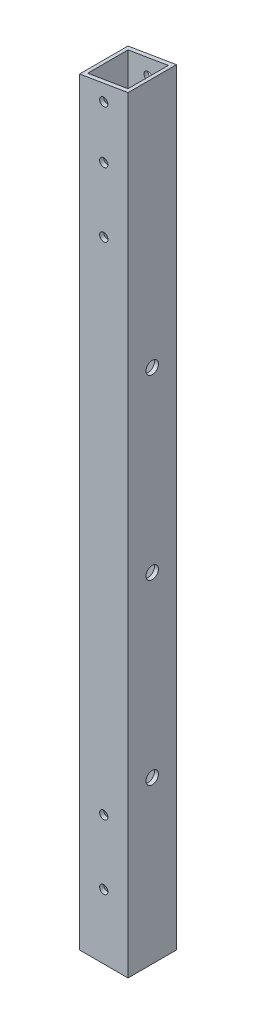
ISO-10303-21;
HEADER;
FILE_DESCRIPTION(('STEP AP214'),'2;1');
FILE_NAME('part.step','',(''),(''),'','','');
FILE_SCHEMA(('AUTOMOTIVE_DESIGN { 1 0 10303 214 1 1 1 1 }'));
ENDSEC;
DATA;
#1=APPLICATION_CONTEXT('core data for automotive mechanical design processes');
#2=APPLICATION_PROTOCOL_DEFINITION('international standard','automotive_design',2000,#1);
#3=PRODUCT_CONTEXT('',#1,'mechanical');
#4=PRODUCT('Part','Part','',(#3));
#5=PRODUCT_RELATED_PRODUCT_CATEGORY('part','',(#4));
#6=PRODUCT_DEFINITION_FORMATION('','',#4);
#7=PRODUCT_DEFINITION_CONTEXT('part definition',#1,'design');
#8=PRODUCT_DEFINITION('design','',#6,#7);
#9=PRODUCT_DEFINITION_SHAPE('','',#8);
#10=(LENGTH_UNIT() NAMED_UNIT(*) SI_UNIT(.MILLI.,.METRE.));
#11=(NAMED_UNIT(*) PLANE_ANGLE_UNIT() SI_UNIT($,.RADIAN.));
#12=(NAMED_UNIT(*) SI_UNIT($,.STERADIAN.) SOLID_ANGLE_UNIT());
#13=UNCERTAINTY_MEASURE_WITH_UNIT(LENGTH_MEASURE(1.E-05),#10,'distance_accuracy_value','');
#14=(GEOMETRIC_REPRESENTATION_CONTEXT(3) GLOBAL_UNCERTAINTY_ASSIGNED_CONTEXT((#13)) GLOBAL_UNIT_ASSIGNED_CONTEXT((#10,
#11,#12)) REPRESENTATION_CONTEXT('',''));
#15=CARTESIAN_POINT('',(0.,0.,0.));
#16=DIRECTION('',(0.,0.,1.));
#17=DIRECTION('',(1.,0.,0.));
#18=AXIS2_PLACEMENT_3D('',#15,#16,#17);
#19=CARTESIAN_POINT('',(-685.8,596.9,0.));
#20=DIRECTION('',(0.,0.,-1.));
#21=DIRECTION('',(-1.,0.,0.));
#22=AXIS2_PLACEMENT_3D('',#19,#20,#21);
#23=PLANE('',#22);
#24=CARTESIAN_POINT('',(-704.85,546.1,0.));
#25=DIRECTION('',(0.,0.,-1.));
#26=DIRECTION('',(-1.,0.,0.));
#27=AXIS2_PLACEMENT_3D('',#24,#25,#26);
#28=CIRCLE('',#27,3.26389999999999);
#29=CARTESIAN_POINT('',(-708.1139,546.1,0.));
#30=VERTEX_POINT('',#29);
#31=EDGE_CURVE('E163',#30,#30,#28,.F.);
#32=ORIENTED_EDGE('',*,*,#31,.F.);
#33=EDGE_LOOP('',(#32));
#34=FACE_BOUND('',#33,.T.);
#35=CARTESIAN_POINT('',(-704.85,587.375,0.));
#36=DIRECTION('',(0.,0.,-1.));
#37=DIRECTION('',(-1.,0.,0.));
#38=AXIS2_PLACEMENT_3D('',#35,#36,#37);
#39=CIRCLE('',#38,3.26389999999999);
#40=CARTESIAN_POINT('',(-708.1139,587.375,0.));
#41=VERTEX_POINT('',#40);
#42=EDGE_CURVE('E159',#41,#41,#39,.F.);
#43=ORIENTED_EDGE('',*,*,#42,.F.);
#44=EDGE_LOOP('',(#43));
#45=FACE_BOUND('',#44,.T.);
#46=DIRECTION('',(-1.,0.,0.));
#47=VECTOR('',#46,1.);
#48=CARTESIAN_POINT('',(-685.8,0.,0.));
#49=LINE('',#48,#47);
#50=CARTESIAN_POINT('',(-685.8,0.,0.));
#51=VERTEX_POINT('',#50);
#52=CARTESIAN_POINT('',(-723.9,0.,0.));
#53=VERTEX_POINT('',#52);
#54=EDGE_CURVE('E234',#51,#53,#49,.T.);
#55=ORIENTED_EDGE('',*,*,#54,.F.);
#56=DIRECTION('',(0.,-1.,0.));
#57=VECTOR('',#56,1.);
#58=CARTESIAN_POINT('',(-685.8,596.9,0.));
#59=LINE('',#58,#57);
#60=CARTESIAN_POINT('',(-685.8,603.25,0.));
#61=VERTEX_POINT('',#60);
#62=EDGE_CURVE('E122',#61,#51,#59,.T.);
#63=ORIENTED_EDGE('',*,*,#62,.F.);
#64=DIRECTION('',(0.986393923832144,0.164398987305358,0.));
#65=VECTOR('',#64,1.);
#66=CARTESIAN_POINT('',(-686.82972972973,603.078378378378,0.));
#67=LINE('',#66,#65);
#68=CARTESIAN_POINT('',(-723.9,596.9,0.));
#69=VERTEX_POINT('',#68);
#70=EDGE_CURVE('E255',#69,#61,#67,.T.);
#71=ORIENTED_EDGE('',*,*,#70,.F.);
#72=DIRECTION('',(0.,-1.,0.));
#73=VECTOR('',#72,1.);
#74=CARTESIAN_POINT('',(-723.9,596.9,0.));
#75=LINE('',#74,#73);
#76=EDGE_CURVE('E50',#69,#53,#75,.T.);
#77=ORIENTED_EDGE('',*,*,#76,.T.);
#78=EDGE_LOOP('',(#55,#63,#71,#77));
#79=FACE_BOUND('',#78,.T.);
#80=CARTESIAN_POINT('',(-704.85,495.3,0.));
#81=DIRECTION('',(0.,0.,-1.));
#82=DIRECTION('',(-1.,0.,0.));
#83=AXIS2_PLACEMENT_3D('',#80,#81,#82);
#84=CIRCLE('',#83,3.26389999999999);
#85=CARTESIAN_POINT('',(-708.1139,495.3,0.));
#86=VERTEX_POINT('',#85);
#87=EDGE_CURVE('E184',#86,#86,#84,.F.);
#88=ORIENTED_EDGE('',*,*,#87,.F.);
#89=EDGE_LOOP('',(#88));
#90=FACE_BOUND('',#89,.T.);
#91=CARTESIAN_POINT('',(-704.85,101.6,0.));
#92=DIRECTION('',(0.,0.,-1.));
#93=DIRECTION('',(-1.,0.,0.));
#94=AXIS2_PLACEMENT_3D('',#91,#92,#93);
#95=CIRCLE('',#94,3.26389999999999);
#96=CARTESIAN_POINT('',(-708.1139,101.6,0.));
#97=VERTEX_POINT('',#96);
#98=EDGE_CURVE('E167',#97,#97,#95,.F.);
#99=ORIENTED_EDGE('',*,*,#98,.F.);
#100=EDGE_LOOP('',(#99));
#101=FACE_BOUND('',#100,.T.);
#102=CARTESIAN_POINT('',(-704.85,50.8,0.));
#103=DIRECTION('',(0.,0.,-1.));
#104=DIRECTION('',(-1.,0.,0.));
#105=AXIS2_PLACEMENT_3D('',#102,#103,#104);
#106=CIRCLE('',#105,3.26389999999999);
#107=CARTESIAN_POINT('',(-708.1139,50.8,0.));
#108=VERTEX_POINT('',#107);
#109=EDGE_CURVE('E473',#108,#108,#106,.F.);
#110=ORIENTED_EDGE('',*,*,#109,.F.);
#111=EDGE_LOOP('',(#110));
#112=FACE_BOUND('',#111,.T.);
#113=ADVANCED_FACE('F33',(#34,#45,#79,#90,#101,#112),#23,.F.);
#114=CARTESIAN_POINT('',(-685.8,596.9,-38.1));
#115=DIRECTION('',(0.,0.,1.));
#116=DIRECTION('',(1.,0.,0.));
#117=AXIS2_PLACEMENT_3D('',#114,#115,#116);
#118=PLANE('',#117);
#119=CARTESIAN_POINT('',(-704.85,50.8,-38.1));
#120=DIRECTION('',(0.,0.,-1.));
#121=DIRECTION('',(-1.,0.,0.));
#122=AXIS2_PLACEMENT_3D('',#119,#120,#121);
#123=CIRCLE('',#122,3.26389999999999);
#124=CARTESIAN_POINT('',(-708.1139,50.8,-38.1));
#125=VERTEX_POINT('',#124);
#126=EDGE_CURVE('E472',#125,#125,#123,.T.);
#127=ORIENTED_EDGE('',*,*,#126,.F.);
#128=EDGE_LOOP('',(#127));
#129=FACE_BOUND('',#128,.T.);
#130=CARTESIAN_POINT('',(-704.85,101.6,-38.1));
#131=DIRECTION('',(0.,0.,-1.));
#132=DIRECTION('',(-1.,0.,0.));
#133=AXIS2_PLACEMENT_3D('',#130,#131,#132);
#134=CIRCLE('',#133,3.26389999999999);
#135=CARTESIAN_POINT('',(-708.1139,101.6,-38.1));
#136=VERTEX_POINT('',#135);
#137=EDGE_CURVE('E174',#136,#136,#134,.T.);
#138=ORIENTED_EDGE('',*,*,#137,.F.);
#139=EDGE_LOOP('',(#138));
#140=FACE_BOUND('',#139,.T.);
#141=CARTESIAN_POINT('',(-704.85,495.3,-38.1));
#142=DIRECTION('',(0.,0.,-1.));
#143=DIRECTION('',(-1.,0.,0.));
#144=AXIS2_PLACEMENT_3D('',#141,#142,#143);
#145=CIRCLE('',#144,3.26389999999999);
#146=CARTESIAN_POINT('',(-708.1139,495.3,-38.1));
#147=VERTEX_POINT('',#146);
#148=EDGE_CURVE('E171',#147,#147,#145,.T.);
#149=ORIENTED_EDGE('',*,*,#148,.F.);
#150=EDGE_LOOP('',(#149));
#151=FACE_BOUND('',#150,.T.);
#152=CARTESIAN_POINT('',(-704.85,587.375,-38.1));
#153=DIRECTION('',(0.,0.,-1.));
#154=DIRECTION('',(-1.,0.,0.));
#155=AXIS2_PLACEMENT_3D('',#152,#153,#154);
#156=CIRCLE('',#155,3.26389999999999);
#157=CARTESIAN_POINT('',(-708.1139,587.375,-38.1));
#158=VERTEX_POINT('',#157);
#159=EDGE_CURVE('E202',#158,#158,#156,.T.);
#160=ORIENTED_EDGE('',*,*,#159,.F.);
#161=EDGE_LOOP('',(#160));
#162=FACE_BOUND('',#161,.T.);
#163=DIRECTION('',(1.,0.,0.));
#164=VECTOR('',#163,1.);
#165=CARTESIAN_POINT('',(-685.8,0.,-38.1));
#166=LINE('',#165,#164);
#167=CARTESIAN_POINT('',(-723.9,0.,-38.1));
#168=VERTEX_POINT('',#167);
#169=CARTESIAN_POINT('',(-685.8,0.,-38.1));
#170=VERTEX_POINT('',#169);
#171=EDGE_CURVE('E240',#168,#170,#166,.T.);
#172=ORIENTED_EDGE('',*,*,#171,.F.);
#173=DIRECTION('',(0.,-1.,0.));
#174=VECTOR('',#173,1.);
#175=CARTESIAN_POINT('',(-723.9,596.9,-38.1));
#176=LINE('',#175,#174);
#177=CARTESIAN_POINT('',(-723.9,596.9,-38.1));
#178=VERTEX_POINT('',#177);
#179=EDGE_CURVE('E132',#178,#168,#176,.T.);
#180=ORIENTED_EDGE('',*,*,#179,.F.);
#181=DIRECTION('',(-0.986393923832144,-0.164398987305358,0.));
#182=VECTOR('',#181,1.);
#183=CARTESIAN_POINT('',(-686.82972972973,603.078378378378,-38.1));
#184=LINE('',#183,#182);
#185=CARTESIAN_POINT('',(-685.8,603.25,-38.1));
#186=VERTEX_POINT('',#185);
#187=EDGE_CURVE('E250',#186,#178,#184,.T.);
#188=ORIENTED_EDGE('',*,*,#187,.F.);
#189=DIRECTION('',(0.,-1.,0.));
#190=VECTOR('',#189,1.);
#191=CARTESIAN_POINT('',(-685.8,596.9,-38.1));
#192=LINE('',#191,#190);
#193=EDGE_CURVE('E134',#186,#170,#192,.T.);
#194=ORIENTED_EDGE('',*,*,#193,.T.);
#195=EDGE_LOOP('',(#172,#180,#188,#194));
#196=FACE_BOUND('',#195,.T.);
#197=CARTESIAN_POINT('',(-704.85,546.1,-38.1));
#198=DIRECTION('',(0.,0.,-1.));
#199=DIRECTION('',(-1.,0.,0.));
#200=AXIS2_PLACEMENT_3D('',#197,#198,#199);
#201=CIRCLE('',#200,3.26389999999999);
#202=CARTESIAN_POINT('',(-708.1139,546.1,-38.1));
#203=VERTEX_POINT('',#202);
#204=EDGE_CURVE('E195',#203,#203,#201,.T.);
#205=ORIENTED_EDGE('',*,*,#204,.F.);
#206=EDGE_LOOP('',(#205));
#207=FACE_BOUND('',#206,.T.);
#208=ADVANCED_FACE('F271',(#129,#140,#151,#162,#196,#207),#118,.F.);
#209=CARTESIAN_POINT('',(-723.9,596.9,-38.1));
#210=DIRECTION('',(1.,0.,0.));
#211=DIRECTION('',(0.,0.,-1.));
#212=AXIS2_PLACEMENT_3D('',#209,#210,#211);
#213=PLANE('',#212);
#214=CARTESIAN_POINT('',(-723.9,127.,-19.05));
#215=DIRECTION('',(-1.,0.,0.));
#216=DIRECTION('',(0.,0.,1.));
#217=AXIS2_PLACEMENT_3D('',#214,#215,#216);
#218=CIRCLE('',#217,4.9022);
#219=CARTESIAN_POINT('',(-723.9,127.,-14.1478));
#220=VERTEX_POINT('',#219);
#221=EDGE_CURVE('E209',#220,#220,#218,.T.);
#222=ORIENTED_EDGE('',*,*,#221,.F.);
#223=EDGE_LOOP('',(#222));
#224=FACE_BOUND('',#223,.T.);
#225=CARTESIAN_POINT('',(-723.9,266.7,-19.05));
#226=DIRECTION('',(-1.,0.,0.));
#227=DIRECTION('',(0.,0.,1.));
#228=AXIS2_PLACEMENT_3D('',#225,#226,#227);
#229=CIRCLE('',#228,4.90220000000002);
#230=CARTESIAN_POINT('',(-723.9,266.7,-14.1478));
#231=VERTEX_POINT('',#230);
#232=EDGE_CURVE('E223',#231,#231,#229,.T.);
#233=ORIENTED_EDGE('',*,*,#232,.F.);
#234=EDGE_LOOP('',(#233));
#235=FACE_BOUND('',#234,.T.);
#236=DIRECTION('',(0.,0.,-1.));
#237=VECTOR('',#236,1.);
#238=CARTESIAN_POINT('',(-723.9,0.,-38.1));
#239=LINE('',#238,#237);
#240=EDGE_CURVE('E113',#53,#168,#239,.T.);
#241=ORIENTED_EDGE('',*,*,#240,.F.);
#242=ORIENTED_EDGE('',*,*,#76,.F.);
#243=DIRECTION('',(0.,0.,1.));
#244=VECTOR('',#243,1.);
#245=CARTESIAN_POINT('',(-723.9,596.9,-38.1));
#246=LINE('',#245,#244);
#247=EDGE_CURVE('E125',#178,#69,#246,.T.);
#248=ORIENTED_EDGE('',*,*,#247,.F.);
#249=ORIENTED_EDGE('',*,*,#179,.T.);
#250=EDGE_LOOP('',(#241,#242,#248,#249));
#251=FACE_BOUND('',#250,.T.);
#252=CARTESIAN_POINT('',(-723.9,406.4,-19.05));
#253=DIRECTION('',(-1.,0.,0.));
#254=DIRECTION('',(0.,0.,1.));
#255=AXIS2_PLACEMENT_3D('',#252,#253,#254);
#256=CIRCLE('',#255,4.90219999999997);
#257=CARTESIAN_POINT('',(-723.9,406.4,-14.1478));
#258=VERTEX_POINT('',#257);
#259=EDGE_CURVE('E216',#258,#258,#256,.T.);
#260=ORIENTED_EDGE('',*,*,#259,.F.);
#261=EDGE_LOOP('',(#260));
#262=FACE_BOUND('',#261,.T.);
#263=ADVANCED_FACE('F35',(#224,#235,#251,#262),#213,.F.);
#264=CARTESIAN_POINT('',(-685.8,596.9,-38.1));
#265=DIRECTION('',(-1.,0.,0.));
#266=DIRECTION('',(0.,0.,1.));
#267=AXIS2_PLACEMENT_3D('',#264,#265,#266);
#268=PLANE('',#267);
#269=CARTESIAN_POINT('',(-685.8,127.,-19.05));
#270=DIRECTION('',(-1.,0.,0.));
#271=DIRECTION('',(0.,0.,1.));
#272=AXIS2_PLACEMENT_3D('',#269,#270,#271);
#273=CIRCLE('',#272,4.9022);
#274=CARTESIAN_POINT('',(-685.8,127.,-14.1478));
#275=VERTEX_POINT('',#274);
#276=EDGE_CURVE('E154',#275,#275,#273,.F.);
#277=ORIENTED_EDGE('',*,*,#276,.F.);
#278=EDGE_LOOP('',(#277));
#279=FACE_BOUND('',#278,.T.);
#280=CARTESIAN_POINT('',(-685.8,406.4,-19.05));
#281=DIRECTION('',(-1.,0.,0.));
#282=DIRECTION('',(0.,0.,1.));
#283=AXIS2_PLACEMENT_3D('',#280,#281,#282);
#284=CIRCLE('',#283,4.90219999999997);
#285=CARTESIAN_POINT('',(-685.8,406.4,-14.1478));
#286=VERTEX_POINT('',#285);
#287=EDGE_CURVE('E149',#286,#286,#284,.F.);
#288=ORIENTED_EDGE('',*,*,#287,.F.);
#289=EDGE_LOOP('',(#288));
#290=FACE_BOUND('',#289,.T.);
#291=DIRECTION('',(0.,0.,1.));
#292=VECTOR('',#291,1.);
#293=CARTESIAN_POINT('',(-685.8,0.,-38.1));
#294=LINE('',#293,#292);
#295=EDGE_CURVE('E237',#170,#51,#294,.T.);
#296=ORIENTED_EDGE('',*,*,#295,.F.);
#297=ORIENTED_EDGE('',*,*,#193,.F.);
#298=DIRECTION('',(0.,0.,-1.));
#299=VECTOR('',#298,1.);
#300=CARTESIAN_POINT('',(-685.8,603.25,-38.1));
#301=LINE('',#300,#299);
#302=EDGE_CURVE('E253',#61,#186,#301,.T.);
#303=ORIENTED_EDGE('',*,*,#302,.F.);
#304=ORIENTED_EDGE('',*,*,#62,.T.);
#305=EDGE_LOOP('',(#296,#297,#303,#304));
#306=FACE_BOUND('',#305,.T.);
#307=CARTESIAN_POINT('',(-685.8,266.7,-19.05));
#308=DIRECTION('',(-1.,0.,0.));
#309=DIRECTION('',(0.,0.,1.));
#310=AXIS2_PLACEMENT_3D('',#307,#308,#309);
#311=CIRCLE('',#310,4.9022);
#312=CARTESIAN_POINT('',(-685.8,266.7,-14.1478));
#313=VERTEX_POINT('',#312);
#314=EDGE_CURVE('E144',#313,#313,#311,.F.);
#315=ORIENTED_EDGE('',*,*,#314,.F.);
#316=EDGE_LOOP('',(#315));
#317=FACE_BOUND('',#316,.T.);
#318=ADVANCED_FACE('F268',(#279,#290,#306,#317),#268,.F.);
#319=CARTESIAN_POINT('',(-723.9,596.9,-38.1));
#320=DIRECTION('',(-0.164398987305358,0.986393923832144,0.));
#321=DIRECTION('',(-0.986393923832144,-0.164398987305358,0.));
#322=AXIS2_PLACEMENT_3D('',#319,#320,#321);
#323=PLANE('',#322);
#324=DIRECTION('',(0.,0.,1.));
#325=VECTOR('',#324,1.);
#326=CARTESIAN_POINT('',(-720.725,597.429166666667,-34.925));
#327=LINE('',#326,#325);
#328=CARTESIAN_POINT('',(-720.725,597.429166666667,-34.925));
#329=VERTEX_POINT('',#328);
#330=CARTESIAN_POINT('',(-720.725,597.429166666667,-3.175));
#331=VERTEX_POINT('',#330);
#332=EDGE_CURVE('E118',#329,#331,#327,.T.);
#333=ORIENTED_EDGE('',*,*,#332,.F.);
#334=DIRECTION('',(-0.986393923832144,-0.164398987305358,0.));
#335=VECTOR('',#334,1.);
#336=CARTESIAN_POINT('',(-689.918918918919,602.563513513514,-34.925));
#337=LINE('',#336,#335);
#338=CARTESIAN_POINT('',(-688.975,602.720833333333,-34.925));
#339=VERTEX_POINT('',#338);
#340=EDGE_CURVE('E246',#339,#329,#337,.T.);
#341=ORIENTED_EDGE('',*,*,#340,.F.);
#342=DIRECTION('',(0.,0.,-1.));
#343=VECTOR('',#342,1.);
#344=CARTESIAN_POINT('',(-688.975,602.720833333333,-34.925));
#345=LINE('',#344,#343);
#346=CARTESIAN_POINT('',(-688.975,602.720833333333,-3.175));
#347=VERTEX_POINT('',#346);
#348=EDGE_CURVE('E243',#347,#339,#345,.T.);
#349=ORIENTED_EDGE('',*,*,#348,.F.);
#350=DIRECTION('',(0.986393923832144,0.164398987305358,0.));
#351=VECTOR('',#350,1.);
#352=CARTESIAN_POINT('',(-689.918918918919,602.563513513514,-3.175));
#353=LINE('',#352,#351);
#354=EDGE_CURVE('E42',#331,#347,#353,.T.);
#355=ORIENTED_EDGE('',*,*,#354,.F.);
#356=EDGE_LOOP('',(#333,#341,#349,#355));
#357=FACE_BOUND('',#356,.T.);
#358=ORIENTED_EDGE('',*,*,#187,.T.);
#359=ORIENTED_EDGE('',*,*,#247,.T.);
#360=ORIENTED_EDGE('',*,*,#70,.T.);
#361=ORIENTED_EDGE('',*,*,#302,.T.);
#362=EDGE_LOOP('',(#358,#359,#360,#361));
#363=FACE_BOUND('',#362,.T.);
#364=ADVANCED_FACE('F260',(#357,#363),#323,.T.);
#365=CARTESIAN_POINT('',(-720.725,596.9,-34.925));
#366=DIRECTION('',(1.,0.,0.));
#367=DIRECTION('',(0.,0.,-1.));
#368=AXIS2_PLACEMENT_3D('',#365,#366,#367);
#369=PLANE('',#368);
#370=CARTESIAN_POINT('',(-720.725,127.,-19.05));
#371=DIRECTION('',(1.,0.,0.));
#372=DIRECTION('',(0.,0.,-1.));
#373=AXIS2_PLACEMENT_3D('',#370,#371,#372);
#374=CIRCLE('',#373,4.9022);
#375=CARTESIAN_POINT('',(-720.725,127.,-23.9522));
#376=VERTEX_POINT('',#375);
#377=EDGE_CURVE('E153',#376,#376,#374,.T.);
#378=ORIENTED_EDGE('',*,*,#377,.F.);
#379=EDGE_LOOP('',(#378));
#380=FACE_BOUND('',#379,.T.);
#381=CARTESIAN_POINT('',(-720.725,406.4,-19.05));
#382=DIRECTION('',(1.,0.,0.));
#383=DIRECTION('',(0.,0.,-1.));
#384=AXIS2_PLACEMENT_3D('',#381,#382,#383);
#385=CIRCLE('',#384,4.90219999999997);
#386=CARTESIAN_POINT('',(-720.725,406.4,-23.9522));
#387=VERTEX_POINT('',#386);
#388=EDGE_CURVE('E145',#387,#387,#385,.T.);
#389=ORIENTED_EDGE('',*,*,#388,.F.);
#390=EDGE_LOOP('',(#389));
#391=FACE_BOUND('',#390,.T.);
#392=CARTESIAN_POINT('',(-720.725,266.7,-19.05));
#393=DIRECTION('',(1.,0.,0.));
#394=DIRECTION('',(0.,0.,-1.));
#395=AXIS2_PLACEMENT_3D('',#392,#393,#394);
#396=CIRCLE('',#395,4.9022);
#397=CARTESIAN_POINT('',(-720.725,266.7,-23.9522));
#398=VERTEX_POINT('',#397);
#399=EDGE_CURVE('E143',#398,#398,#396,.T.);
#400=ORIENTED_EDGE('',*,*,#399,.F.);
#401=EDGE_LOOP('',(#400));
#402=FACE_BOUND('',#401,.T.);
#403=DIRECTION('',(0.,-1.,0.));
#404=VECTOR('',#403,1.);
#405=CARTESIAN_POINT('',(-720.725,596.9,-3.175));
#406=LINE('',#405,#404);
#407=CARTESIAN_POINT('',(-720.725,0.,-3.175));
#408=VERTEX_POINT('',#407);
#409=EDGE_CURVE('E109',#331,#408,#406,.T.);
#410=ORIENTED_EDGE('',*,*,#409,.T.);
#411=DIRECTION('',(0.,0.,-1.));
#412=VECTOR('',#411,1.);
#413=CARTESIAN_POINT('',(-720.725,0.,-34.925));
#414=LINE('',#413,#412);
#415=CARTESIAN_POINT('',(-720.725,0.,-34.925));
#416=VERTEX_POINT('',#415);
#417=EDGE_CURVE('E11',#408,#416,#414,.T.);
#418=ORIENTED_EDGE('',*,*,#417,.T.);
#419=DIRECTION('',(0.,-1.,0.));
#420=VECTOR('',#419,1.);
#421=CARTESIAN_POINT('',(-720.725,596.9,-34.925));
#422=LINE('',#421,#420);
#423=EDGE_CURVE('E130',#329,#416,#422,.T.);
#424=ORIENTED_EDGE('',*,*,#423,.F.);
#425=ORIENTED_EDGE('',*,*,#332,.T.);
#426=EDGE_LOOP('',(#410,#418,#424,#425));
#427=FACE_BOUND('',#426,.T.);
#428=ADVANCED_FACE('F117',(#380,#391,#402,#427),#369,.T.);
#429=CARTESIAN_POINT('',(-688.975,596.9,-34.925));
#430=DIRECTION('',(0.,0.,1.));
#431=DIRECTION('',(1.,0.,0.));
#432=AXIS2_PLACEMENT_3D('',#429,#430,#431);
#433=PLANE('',#432);
#434=CARTESIAN_POINT('',(-704.85,50.8,-34.925));
#435=DIRECTION('',(0.,0.,1.));
#436=DIRECTION('',(1.,0.,0.));
#437=AXIS2_PLACEMENT_3D('',#434,#435,#436);
#438=CIRCLE('',#437,3.26389999999999);
#439=CARTESIAN_POINT('',(-701.5861,50.8,-34.925));
#440=VERTEX_POINT('',#439);
#441=EDGE_CURVE('E179',#440,#440,#438,.T.);
#442=ORIENTED_EDGE('',*,*,#441,.F.);
#443=EDGE_LOOP('',(#442));
#444=FACE_BOUND('',#443,.T.);
#445=CARTESIAN_POINT('',(-704.85,101.6,-34.925));
#446=DIRECTION('',(0.,0.,1.));
#447=DIRECTION('',(1.,0.,0.));
#448=AXIS2_PLACEMENT_3D('',#445,#446,#447);
#449=CIRCLE('',#448,3.26389999999999);
#450=CARTESIAN_POINT('',(-701.5861,101.6,-34.925));
#451=VERTEX_POINT('',#450);
#452=EDGE_CURVE('E166',#451,#451,#449,.T.);
#453=ORIENTED_EDGE('',*,*,#452,.F.);
#454=EDGE_LOOP('',(#453));
#455=FACE_BOUND('',#454,.T.);
#456=CARTESIAN_POINT('',(-704.85,495.3,-34.925));
#457=DIRECTION('',(0.,0.,1.));
#458=DIRECTION('',(1.,0.,0.));
#459=AXIS2_PLACEMENT_3D('',#456,#457,#458);
#460=CIRCLE('',#459,3.26389999999999);
#461=CARTESIAN_POINT('',(-701.5861,495.3,-34.925));
#462=VERTEX_POINT('',#461);
#463=EDGE_CURVE('E187',#462,#462,#460,.T.);
#464=ORIENTED_EDGE('',*,*,#463,.F.);
#465=EDGE_LOOP('',(#464));
#466=FACE_BOUND('',#465,.T.);
#467=CARTESIAN_POINT('',(-704.85,546.1,-34.925));
#468=DIRECTION('',(0.,0.,1.));
#469=DIRECTION('',(1.,0.,0.));
#470=AXIS2_PLACEMENT_3D('',#467,#468,#469);
#471=CIRCLE('',#470,3.26389999999999);
#472=CARTESIAN_POINT('',(-701.5861,546.1,-34.925));
#473=VERTEX_POINT('',#472);
#474=EDGE_CURVE('E162',#473,#473,#471,.T.);
#475=ORIENTED_EDGE('',*,*,#474,.F.);
#476=EDGE_LOOP('',(#475));
#477=FACE_BOUND('',#476,.T.);
#478=CARTESIAN_POINT('',(-704.85,587.375,-34.925));
#479=DIRECTION('',(0.,0.,1.));
#480=DIRECTION('',(1.,0.,0.));
#481=AXIS2_PLACEMENT_3D('',#478,#479,#480);
#482=CIRCLE('',#481,3.26389999999999);
#483=CARTESIAN_POINT('',(-701.5861,587.375,-34.925));
#484=VERTEX_POINT('',#483);
#485=EDGE_CURVE('E158',#484,#484,#482,.T.);
#486=ORIENTED_EDGE('',*,*,#485,.F.);
#487=EDGE_LOOP('',(#486));
#488=FACE_BOUND('',#487,.T.);
#489=ORIENTED_EDGE('',*,*,#423,.T.);
#490=DIRECTION('',(1.,0.,0.));
#491=VECTOR('',#490,1.);
#492=CARTESIAN_POINT('',(-688.975,0.,-34.925));
#493=LINE('',#492,#491);
#494=CARTESIAN_POINT('',(-688.975,0.,-34.925));
#495=VERTEX_POINT('',#494);
#496=EDGE_CURVE('E58',#416,#495,#493,.T.);
#497=ORIENTED_EDGE('',*,*,#496,.T.);
#498=DIRECTION('',(0.,-1.,0.));
#499=VECTOR('',#498,1.);
#500=CARTESIAN_POINT('',(-688.975,596.9,-34.925));
#501=LINE('',#500,#499);
#502=EDGE_CURVE('E120',#339,#495,#501,.T.);
#503=ORIENTED_EDGE('',*,*,#502,.F.);
#504=ORIENTED_EDGE('',*,*,#340,.T.);
#505=EDGE_LOOP('',(#489,#497,#503,#504));
#506=FACE_BOUND('',#505,.T.);
#507=ADVANCED_FACE('F306',(#444,#455,#466,#477,#488,#506),#433,.T.);
#508=CARTESIAN_POINT('',(-688.975,596.9,-34.925));
#509=DIRECTION('',(-1.,0.,0.));
#510=DIRECTION('',(0.,0.,1.));
#511=AXIS2_PLACEMENT_3D('',#508,#509,#510);
#512=PLANE('',#511);
#513=CARTESIAN_POINT('',(-688.975,127.,-19.05));
#514=DIRECTION('',(-1.,0.,0.));
#515=DIRECTION('',(0.,0.,1.));
#516=AXIS2_PLACEMENT_3D('',#513,#514,#515);
#517=CIRCLE('',#516,4.9022);
#518=CARTESIAN_POINT('',(-688.975,127.,-14.1478));
#519=VERTEX_POINT('',#518);
#520=EDGE_CURVE('E150',#519,#519,#517,.T.);
#521=ORIENTED_EDGE('',*,*,#520,.F.);
#522=EDGE_LOOP('',(#521));
#523=FACE_BOUND('',#522,.T.);
#524=CARTESIAN_POINT('',(-688.975,406.4,-19.05));
#525=DIRECTION('',(-1.,0.,0.));
#526=DIRECTION('',(0.,0.,1.));
#527=AXIS2_PLACEMENT_3D('',#524,#525,#526);
#528=CIRCLE('',#527,4.90219999999997);
#529=CARTESIAN_POINT('',(-688.975,406.4,-14.1478));
#530=VERTEX_POINT('',#529);
#531=EDGE_CURVE('E148',#530,#530,#528,.T.);
#532=ORIENTED_EDGE('',*,*,#531,.F.);
#533=EDGE_LOOP('',(#532));
#534=FACE_BOUND('',#533,.T.);
#535=CARTESIAN_POINT('',(-688.975,266.7,-19.05));
#536=DIRECTION('',(-1.,0.,0.));
#537=DIRECTION('',(0.,0.,1.));
#538=AXIS2_PLACEMENT_3D('',#535,#536,#537);
#539=CIRCLE('',#538,4.9022);
#540=CARTESIAN_POINT('',(-688.975,266.7,-14.1478));
#541=VERTEX_POINT('',#540);
#542=EDGE_CURVE('E140',#541,#541,#539,.T.);
#543=ORIENTED_EDGE('',*,*,#542,.F.);
#544=EDGE_LOOP('',(#543));
#545=FACE_BOUND('',#544,.T.);
#546=ORIENTED_EDGE('',*,*,#502,.T.);
#547=DIRECTION('',(0.,0.,1.));
#548=VECTOR('',#547,1.);
#549=CARTESIAN_POINT('',(-688.975,0.,-34.925));
#550=LINE('',#549,#548);
#551=CARTESIAN_POINT('',(-688.975,0.,-3.175));
#552=VERTEX_POINT('',#551);
#553=EDGE_CURVE('E114',#495,#552,#550,.T.);
#554=ORIENTED_EDGE('',*,*,#553,.T.);
#555=DIRECTION('',(0.,-1.,0.));
#556=VECTOR('',#555,1.);
#557=CARTESIAN_POINT('',(-688.975,596.9,-3.175));
#558=LINE('',#557,#556);
#559=EDGE_CURVE('E111',#347,#552,#558,.T.);
#560=ORIENTED_EDGE('',*,*,#559,.F.);
#561=ORIENTED_EDGE('',*,*,#348,.T.);
#562=EDGE_LOOP('',(#546,#554,#560,#561));
#563=FACE_BOUND('',#562,.T.);
#564=ADVANCED_FACE('F310',(#523,#534,#545,#563),#512,.T.);
#565=CARTESIAN_POINT('',(-688.975,596.9,-3.175));
#566=DIRECTION('',(0.,0.,-1.));
#567=DIRECTION('',(-1.,0.,0.));
#568=AXIS2_PLACEMENT_3D('',#565,#566,#567);
#569=PLANE('',#568);
#570=CARTESIAN_POINT('',(-704.85,50.8,-3.175));
#571=DIRECTION('',(0.,0.,-1.));
#572=DIRECTION('',(-1.,0.,0.));
#573=AXIS2_PLACEMENT_3D('',#570,#571,#572);
#574=CIRCLE('',#573,3.26389999999999);
#575=CARTESIAN_POINT('',(-708.1139,50.8,-3.175));
#576=VERTEX_POINT('',#575);
#577=EDGE_CURVE('E37',#576,#576,#574,.T.);
#578=ORIENTED_EDGE('',*,*,#577,.F.);
#579=EDGE_LOOP('',(#578));
#580=FACE_BOUND('',#579,.T.);
#581=CARTESIAN_POINT('',(-704.85,101.6,-3.175));
#582=DIRECTION('',(0.,0.,-1.));
#583=DIRECTION('',(-1.,0.,0.));
#584=AXIS2_PLACEMENT_3D('',#581,#582,#583);
#585=CIRCLE('',#584,3.26389999999999);
#586=CARTESIAN_POINT('',(-708.1139,101.6,-3.175));
#587=VERTEX_POINT('',#586);
#588=EDGE_CURVE('E164',#587,#587,#585,.T.);
#589=ORIENTED_EDGE('',*,*,#588,.F.);
#590=EDGE_LOOP('',(#589));
#591=FACE_BOUND('',#590,.T.);
#592=CARTESIAN_POINT('',(-704.85,495.3,-3.175));
#593=DIRECTION('',(0.,0.,-1.));
#594=DIRECTION('',(-1.,0.,0.));
#595=AXIS2_PLACEMENT_3D('',#592,#593,#594);
#596=CIRCLE('',#595,3.26389999999999);
#597=CARTESIAN_POINT('',(-708.1139,495.3,-3.175));
#598=VERTEX_POINT('',#597);
#599=EDGE_CURVE('E192',#598,#598,#596,.T.);
#600=ORIENTED_EDGE('',*,*,#599,.F.);
#601=EDGE_LOOP('',(#600));
#602=FACE_BOUND('',#601,.T.);
#603=CARTESIAN_POINT('',(-704.85,546.1,-3.175));
#604=DIRECTION('',(0.,0.,-1.));
#605=DIRECTION('',(-1.,0.,0.));
#606=AXIS2_PLACEMENT_3D('',#603,#604,#605);
#607=CIRCLE('',#606,3.26389999999999);
#608=CARTESIAN_POINT('',(-708.1139,546.1,-3.175));
#609=VERTEX_POINT('',#608);
#610=EDGE_CURVE('E160',#609,#609,#607,.T.);
#611=ORIENTED_EDGE('',*,*,#610,.F.);
#612=EDGE_LOOP('',(#611));
#613=FACE_BOUND('',#612,.T.);
#614=CARTESIAN_POINT('',(-704.85,587.375,-3.175));
#615=DIRECTION('',(0.,0.,-1.));
#616=DIRECTION('',(-1.,0.,0.));
#617=AXIS2_PLACEMENT_3D('',#614,#615,#616);
#618=CIRCLE('',#617,3.26389999999999);
#619=CARTESIAN_POINT('',(-708.1139,587.375,-3.175));
#620=VERTEX_POINT('',#619);
#621=EDGE_CURVE('E155',#620,#620,#618,.T.);
#622=ORIENTED_EDGE('',*,*,#621,.F.);
#623=EDGE_LOOP('',(#622));
#624=FACE_BOUND('',#623,.T.);
#625=ORIENTED_EDGE('',*,*,#559,.T.);
#626=DIRECTION('',(-1.,0.,0.));
#627=VECTOR('',#626,1.);
#628=CARTESIAN_POINT('',(-688.975,0.,-3.175));
#629=LINE('',#628,#627);
#630=EDGE_CURVE('E100',#552,#408,#629,.T.);
#631=ORIENTED_EDGE('',*,*,#630,.T.);
#632=ORIENTED_EDGE('',*,*,#409,.F.);
#633=ORIENTED_EDGE('',*,*,#354,.T.);
#634=EDGE_LOOP('',(#625,#631,#632,#633));
#635=FACE_BOUND('',#634,.T.);
#636=ADVANCED_FACE('F107',(#580,#591,#602,#613,#624,#635),#569,.T.);
#637=CARTESIAN_POINT('',(-723.9,0.,0.));
#638=DIRECTION('',(0.,-1.,0.));
#639=DIRECTION('',(1.,0.,0.));
#640=AXIS2_PLACEMENT_3D('',#637,#638,#639);
#641=PLANE('',#640);
#642=ORIENTED_EDGE('',*,*,#630,.F.);
#643=ORIENTED_EDGE('',*,*,#553,.F.);
#644=ORIENTED_EDGE('',*,*,#496,.F.);
#645=ORIENTED_EDGE('',*,*,#417,.F.);
#646=EDGE_LOOP('',(#642,#643,#644,#645));
#647=FACE_BOUND('',#646,.T.);
#648=ORIENTED_EDGE('',*,*,#240,.T.);
#649=ORIENTED_EDGE('',*,*,#171,.T.);
#650=ORIENTED_EDGE('',*,*,#295,.T.);
#651=ORIENTED_EDGE('',*,*,#54,.T.);
#652=EDGE_LOOP('',(#648,#649,#650,#651));
#653=FACE_BOUND('',#652,.T.);
#654=ADVANCED_FACE('F98',(#647,#653),#641,.T.);
#655=CARTESIAN_POINT('',(-723.9,266.7,-19.05));
#656=DIRECTION('',(-1.,0.,0.));
#657=DIRECTION('',(0.,0.,1.));
#658=AXIS2_PLACEMENT_3D('',#655,#656,#657);
#659=CYLINDRICAL_SURFACE('',#658,4.9022);
#660=ORIENTED_EDGE('',*,*,#542,.T.);
#661=EDGE_LOOP('',(#660));
#662=FACE_BOUND('',#661,.T.);
#663=ORIENTED_EDGE('',*,*,#314,.T.);
#664=EDGE_LOOP('',(#663));
#665=FACE_BOUND('',#664,.T.);
#666=ADVANCED_FACE('F323',(#662,#665),#659,.F.);
#667=ORIENTED_EDGE('',*,*,#399,.T.);
#668=EDGE_LOOP('',(#667));
#669=FACE_BOUND('',#668,.T.);
#670=ORIENTED_EDGE('',*,*,#232,.T.);
#671=EDGE_LOOP('',(#670));
#672=FACE_BOUND('',#671,.T.);
#673=ADVANCED_FACE('F326',(#669,#672),#659,.F.);
#674=CARTESIAN_POINT('',(-723.9,406.4,-19.05));
#675=DIRECTION('',(-1.,0.,0.));
#676=DIRECTION('',(0.,0.,1.));
#677=AXIS2_PLACEMENT_3D('',#674,#675,#676);
#678=CYLINDRICAL_SURFACE('',#677,4.90219999999997);
#679=ORIENTED_EDGE('',*,*,#388,.T.);
#680=EDGE_LOOP('',(#679));
#681=FACE_BOUND('',#680,.T.);
#682=ORIENTED_EDGE('',*,*,#259,.T.);
#683=EDGE_LOOP('',(#682));
#684=FACE_BOUND('',#683,.T.);
#685=ADVANCED_FACE('F328',(#681,#684),#678,.F.);
#686=ORIENTED_EDGE('',*,*,#531,.T.);
#687=EDGE_LOOP('',(#686));
#688=FACE_BOUND('',#687,.T.);
#689=ORIENTED_EDGE('',*,*,#287,.T.);
#690=EDGE_LOOP('',(#689));
#691=FACE_BOUND('',#690,.T.);
#692=ADVANCED_FACE('F331',(#688,#691),#678,.F.);
#693=CARTESIAN_POINT('',(-723.9,127.,-19.05));
#694=DIRECTION('',(-1.,0.,0.));
#695=DIRECTION('',(0.,0.,1.));
#696=AXIS2_PLACEMENT_3D('',#693,#694,#695);
#697=CYLINDRICAL_SURFACE('',#696,4.9022);
#698=ORIENTED_EDGE('',*,*,#520,.T.);
#699=EDGE_LOOP('',(#698));
#700=FACE_BOUND('',#699,.T.);
#701=ORIENTED_EDGE('',*,*,#276,.T.);
#702=EDGE_LOOP('',(#701));
#703=FACE_BOUND('',#702,.T.);
#704=ADVANCED_FACE('F333',(#700,#703),#697,.F.);
#705=ORIENTED_EDGE('',*,*,#377,.T.);
#706=EDGE_LOOP('',(#705));
#707=FACE_BOUND('',#706,.T.);
#708=ORIENTED_EDGE('',*,*,#221,.T.);
#709=EDGE_LOOP('',(#708));
#710=FACE_BOUND('',#709,.T.);
#711=ADVANCED_FACE('F335',(#707,#710),#697,.F.);
#712=CARTESIAN_POINT('',(-704.85,587.375,-38.1));
#713=DIRECTION('',(0.,0.,-1.));
#714=DIRECTION('',(-1.,0.,0.));
#715=AXIS2_PLACEMENT_3D('',#712,#713,#714);
#716=CYLINDRICAL_SURFACE('',#715,3.26389999999999);
#717=ORIENTED_EDGE('',*,*,#621,.T.);
#718=EDGE_LOOP('',(#717));
#719=FACE_BOUND('',#718,.T.);
#720=ORIENTED_EDGE('',*,*,#42,.T.);
#721=EDGE_LOOP('',(#720));
#722=FACE_BOUND('',#721,.T.);
#723=ADVANCED_FACE('F290',(#719,#722),#716,.F.);
#724=ORIENTED_EDGE('',*,*,#485,.T.);
#725=EDGE_LOOP('',(#724));
#726=FACE_BOUND('',#725,.T.);
#727=ORIENTED_EDGE('',*,*,#159,.T.);
#728=EDGE_LOOP('',(#727));
#729=FACE_BOUND('',#728,.T.);
#730=ADVANCED_FACE('F281',(#726,#729),#716,.F.);
#731=CARTESIAN_POINT('',(-704.85,546.1,-38.1));
#732=DIRECTION('',(0.,0.,-1.));
#733=DIRECTION('',(-1.,0.,0.));
#734=AXIS2_PLACEMENT_3D('',#731,#732,#733);
#735=CYLINDRICAL_SURFACE('',#734,3.26389999999999);
#736=ORIENTED_EDGE('',*,*,#474,.T.);
#737=EDGE_LOOP('',(#736));
#738=FACE_BOUND('',#737,.T.);
#739=ORIENTED_EDGE('',*,*,#204,.T.);
#740=EDGE_LOOP('',(#739));
#741=FACE_BOUND('',#740,.T.);
#742=ADVANCED_FACE('F278',(#738,#741),#735,.F.);
#743=ORIENTED_EDGE('',*,*,#610,.T.);
#744=EDGE_LOOP('',(#743));
#745=FACE_BOUND('',#744,.T.);
#746=ORIENTED_EDGE('',*,*,#31,.T.);
#747=EDGE_LOOP('',(#746));
#748=FACE_BOUND('',#747,.T.);
#749=ADVANCED_FACE('F280',(#745,#748),#735,.F.);
#750=CARTESIAN_POINT('',(-704.85,495.3,-38.1));
#751=DIRECTION('',(0.,0.,-1.));
#752=DIRECTION('',(-1.,0.,0.));
#753=AXIS2_PLACEMENT_3D('',#750,#751,#752);
#754=CYLINDRICAL_SURFACE('',#753,3.26389999999999);
#755=ORIENTED_EDGE('',*,*,#599,.T.);
#756=EDGE_LOOP('',(#755));
#757=FACE_BOUND('',#756,.T.);
#758=ORIENTED_EDGE('',*,*,#87,.T.);
#759=EDGE_LOOP('',(#758));
#760=FACE_BOUND('',#759,.T.);
#761=ADVANCED_FACE('F288',(#757,#760),#754,.F.);
#762=ORIENTED_EDGE('',*,*,#463,.T.);
#763=EDGE_LOOP('',(#762));
#764=FACE_BOUND('',#763,.T.);
#765=ORIENTED_EDGE('',*,*,#148,.T.);
#766=EDGE_LOOP('',(#765));
#767=FACE_BOUND('',#766,.T.);
#768=ADVANCED_FACE('F419',(#764,#767),#754,.F.);
#769=CARTESIAN_POINT('',(-704.85,101.6,-38.1));
#770=DIRECTION('',(0.,0.,-1.));
#771=DIRECTION('',(-1.,0.,0.));
#772=AXIS2_PLACEMENT_3D('',#769,#770,#771);
#773=CYLINDRICAL_SURFACE('',#772,3.26389999999999);
#774=ORIENTED_EDGE('',*,*,#588,.T.);
#775=EDGE_LOOP('',(#774));
#776=FACE_BOUND('',#775,.T.);
#777=ORIENTED_EDGE('',*,*,#98,.T.);
#778=EDGE_LOOP('',(#777));
#779=FACE_BOUND('',#778,.T.);
#780=ADVANCED_FACE('F428',(#776,#779),#773,.F.);
#781=ORIENTED_EDGE('',*,*,#452,.T.);
#782=EDGE_LOOP('',(#781));
#783=FACE_BOUND('',#782,.T.);
#784=ORIENTED_EDGE('',*,*,#137,.T.);
#785=EDGE_LOOP('',(#784));
#786=FACE_BOUND('',#785,.T.);
#787=ADVANCED_FACE('F437',(#783,#786),#773,.F.);
#788=CARTESIAN_POINT('',(-704.85,50.8,-38.1));
#789=DIRECTION('',(0.,0.,-1.));
#790=DIRECTION('',(-1.,0.,0.));
#791=AXIS2_PLACEMENT_3D('',#788,#789,#790);
#792=CYLINDRICAL_SURFACE('',#791,3.26389999999999);
#793=ORIENTED_EDGE('',*,*,#577,.T.);
#794=EDGE_LOOP('',(#793));
#795=FACE_BOUND('',#794,.T.);
#796=ORIENTED_EDGE('',*,*,#109,.T.);
#797=EDGE_LOOP('',(#796));
#798=FACE_BOUND('',#797,.T.);
#799=ADVANCED_FACE('F446',(#795,#798),#792,.F.);
#800=ORIENTED_EDGE('',*,*,#441,.T.);
#801=EDGE_LOOP('',(#800));
#802=FACE_BOUND('',#801,.T.);
#803=ORIENTED_EDGE('',*,*,#126,.T.);
#804=EDGE_LOOP('',(#803));
#805=FACE_BOUND('',#804,.T.);
#806=ADVANCED_FACE('F455',(#802,#805),#792,.F.);
#807=CLOSED_SHELL('',(#113,#208,#263,#318,#364,#428,#507,#564,#636,#654,#666,#673,#685,#692,
#704,#711,#723,#730,#742,#749,#761,#768,#780,#787,#799,#806));
#808=MANIFOLD_SOLID_BREP('B2',#807);
#809=ADVANCED_BREP_SHAPE_REPRESENTATION('',(#18,#808),#14);
#810=SHAPE_DEFINITION_REPRESENTATION(#9,#809);
ENDSEC;
END-ISO-10303-21;
